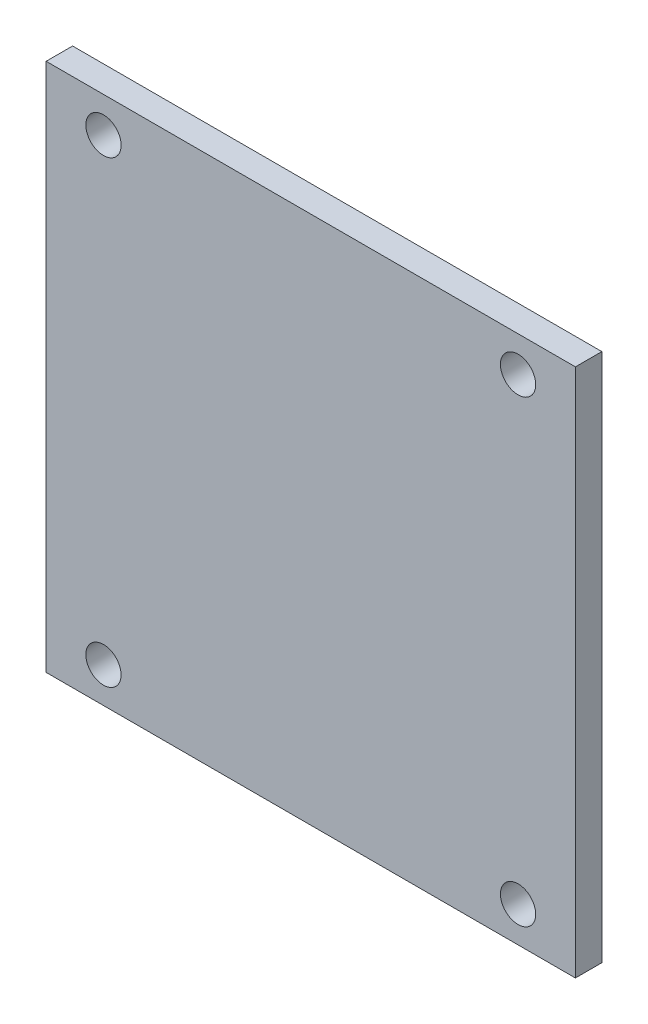
ISO-10303-21;
HEADER;
FILE_DESCRIPTION(('STEP AP214'),'2;1');
FILE_NAME('part.step','',(''),(''),'','','');
FILE_SCHEMA(('AUTOMOTIVE_DESIGN { 1 0 10303 214 1 1 1 1 }'));
ENDSEC;
DATA;
#1=APPLICATION_CONTEXT('core data for automotive mechanical design processes');
#2=APPLICATION_PROTOCOL_DEFINITION('international standard','automotive_design',2000,#1);
#3=PRODUCT_CONTEXT('',#1,'mechanical');
#4=PRODUCT('Part','Part','',(#3));
#5=PRODUCT_RELATED_PRODUCT_CATEGORY('part','',(#4));
#6=PRODUCT_DEFINITION_FORMATION('','',#4);
#7=PRODUCT_DEFINITION_CONTEXT('part definition',#1,'design');
#8=PRODUCT_DEFINITION('design','',#6,#7);
#9=PRODUCT_DEFINITION_SHAPE('','',#8);
#10=(LENGTH_UNIT() NAMED_UNIT(*) SI_UNIT(.MILLI.,.METRE.));
#11=(NAMED_UNIT(*) PLANE_ANGLE_UNIT() SI_UNIT($,.RADIAN.));
#12=(NAMED_UNIT(*) SI_UNIT($,.STERADIAN.) SOLID_ANGLE_UNIT());
#13=UNCERTAINTY_MEASURE_WITH_UNIT(LENGTH_MEASURE(1.E-05),#10,'distance_accuracy_value','');
#14=(GEOMETRIC_REPRESENTATION_CONTEXT(3) GLOBAL_UNCERTAINTY_ASSIGNED_CONTEXT((#13)) GLOBAL_UNIT_ASSIGNED_CONTEXT((#10,
#11,#12)) REPRESENTATION_CONTEXT('',''));
#15=CARTESIAN_POINT('',(0.,0.,0.));
#16=DIRECTION('',(0.,0.,1.));
#17=DIRECTION('',(1.,0.,0.));
#18=AXIS2_PLACEMENT_3D('',#15,#16,#17);
#19=CARTESIAN_POINT('',(30.,-30.,3.));
#20=DIRECTION('',(-1.,0.,0.));
#21=DIRECTION('',(0.,0.,1.));
#22=AXIS2_PLACEMENT_3D('',#19,#20,#21);
#23=PLANE('',#22);
#24=DIRECTION('',(0.,1.,0.));
#25=VECTOR('',#24,1.);
#26=CARTESIAN_POINT('',(30.,-30.,0.));
#27=LINE('',#26,#25);
#28=CARTESIAN_POINT('',(30.,-30.,0.));
#29=VERTEX_POINT('',#28);
#30=CARTESIAN_POINT('',(30.,30.,0.));
#31=VERTEX_POINT('',#30);
#32=EDGE_CURVE('E100',#29,#31,#27,.T.);
#33=ORIENTED_EDGE('',*,*,#32,.T.);
#34=DIRECTION('',(0.,0.,-1.));
#35=VECTOR('',#34,1.);
#36=CARTESIAN_POINT('',(30.,30.,3.));
#37=LINE('',#36,#35);
#38=CARTESIAN_POINT('',(30.,30.,3.));
#39=VERTEX_POINT('',#38);
#40=EDGE_CURVE('E11',#39,#31,#37,.T.);
#41=ORIENTED_EDGE('',*,*,#40,.F.);
#42=DIRECTION('',(0.,1.,0.));
#43=VECTOR('',#42,1.);
#44=CARTESIAN_POINT('',(30.,-30.,3.));
#45=LINE('',#44,#43);
#46=CARTESIAN_POINT('',(30.,-30.,3.));
#47=VERTEX_POINT('',#46);
#48=EDGE_CURVE('E88',#47,#39,#45,.T.);
#49=ORIENTED_EDGE('',*,*,#48,.F.);
#50=DIRECTION('',(0.,0.,-1.));
#51=VECTOR('',#50,1.);
#52=CARTESIAN_POINT('',(30.,-30.,3.));
#53=LINE('',#52,#51);
#54=EDGE_CURVE('E96',#47,#29,#53,.T.);
#55=ORIENTED_EDGE('',*,*,#54,.T.);
#56=EDGE_LOOP('',(#33,#41,#49,#55));
#57=FACE_BOUND('',#56,.T.);
#58=ADVANCED_FACE('F37',(#57),#23,.F.);
#59=CARTESIAN_POINT('',(-30.,30.,3.));
#60=DIRECTION('',(0.,-1.,0.));
#61=DIRECTION('',(0.,0.,-1.));
#62=AXIS2_PLACEMENT_3D('',#59,#60,#61);
#63=PLANE('',#62);
#64=DIRECTION('',(-1.,0.,0.));
#65=VECTOR('',#64,1.);
#66=CARTESIAN_POINT('',(-30.,30.,0.));
#67=LINE('',#66,#65);
#68=CARTESIAN_POINT('',(-30.,30.,0.));
#69=VERTEX_POINT('',#68);
#70=EDGE_CURVE('E92',#31,#69,#67,.T.);
#71=ORIENTED_EDGE('',*,*,#70,.T.);
#72=DIRECTION('',(0.,0.,-1.));
#73=VECTOR('',#72,1.);
#74=CARTESIAN_POINT('',(-30.,30.,3.));
#75=LINE('',#74,#73);
#76=CARTESIAN_POINT('',(-30.,30.,3.));
#77=VERTEX_POINT('',#76);
#78=EDGE_CURVE('E45',#77,#69,#75,.T.);
#79=ORIENTED_EDGE('',*,*,#78,.F.);
#80=DIRECTION('',(-1.,0.,0.));
#81=VECTOR('',#80,1.);
#82=CARTESIAN_POINT('',(-30.,30.,3.));
#83=LINE('',#82,#81);
#84=EDGE_CURVE('E83',#39,#77,#83,.T.);
#85=ORIENTED_EDGE('',*,*,#84,.F.);
#86=ORIENTED_EDGE('',*,*,#40,.T.);
#87=EDGE_LOOP('',(#71,#79,#85,#86));
#88=FACE_BOUND('',#87,.T.);
#89=ADVANCED_FACE('F91',(#88),#63,.F.);
#90=CARTESIAN_POINT('',(-30.,-30.,3.));
#91=DIRECTION('',(1.,0.,0.));
#92=DIRECTION('',(0.,0.,-1.));
#93=AXIS2_PLACEMENT_3D('',#90,#91,#92);
#94=PLANE('',#93);
#95=DIRECTION('',(0.,-1.,0.));
#96=VECTOR('',#95,1.);
#97=CARTESIAN_POINT('',(-30.,-30.,0.));
#98=LINE('',#97,#96);
#99=CARTESIAN_POINT('',(-30.,-30.,0.));
#100=VERTEX_POINT('',#99);
#101=EDGE_CURVE('E70',#69,#100,#98,.T.);
#102=ORIENTED_EDGE('',*,*,#101,.T.);
#103=DIRECTION('',(0.,0.,-1.));
#104=VECTOR('',#103,1.);
#105=CARTESIAN_POINT('',(-30.,-30.,3.));
#106=LINE('',#105,#104);
#107=CARTESIAN_POINT('',(-30.,-30.,3.));
#108=VERTEX_POINT('',#107);
#109=EDGE_CURVE('E93',#108,#100,#106,.T.);
#110=ORIENTED_EDGE('',*,*,#109,.F.);
#111=DIRECTION('',(0.,-1.,0.));
#112=VECTOR('',#111,1.);
#113=CARTESIAN_POINT('',(-30.,-30.,3.));
#114=LINE('',#113,#112);
#115=EDGE_CURVE('E86',#77,#108,#114,.T.);
#116=ORIENTED_EDGE('',*,*,#115,.F.);
#117=ORIENTED_EDGE('',*,*,#78,.T.);
#118=EDGE_LOOP('',(#102,#110,#116,#117));
#119=FACE_BOUND('',#118,.T.);
#120=ADVANCED_FACE('F94',(#119),#94,.F.);
#121=CARTESIAN_POINT('',(-30.,-30.,3.));
#122=DIRECTION('',(0.,1.,0.));
#123=DIRECTION('',(0.,0.,1.));
#124=AXIS2_PLACEMENT_3D('',#121,#122,#123);
#125=PLANE('',#124);
#126=DIRECTION('',(1.,0.,0.));
#127=VECTOR('',#126,1.);
#128=CARTESIAN_POINT('',(-30.,-30.,0.));
#129=LINE('',#128,#127);
#130=EDGE_CURVE('E76',#100,#29,#129,.T.);
#131=ORIENTED_EDGE('',*,*,#130,.T.);
#132=ORIENTED_EDGE('',*,*,#54,.F.);
#133=DIRECTION('',(1.,0.,0.));
#134=VECTOR('',#133,1.);
#135=CARTESIAN_POINT('',(-30.,-30.,3.));
#136=LINE('',#135,#134);
#137=EDGE_CURVE('E53',#108,#47,#136,.T.);
#138=ORIENTED_EDGE('',*,*,#137,.F.);
#139=ORIENTED_EDGE('',*,*,#109,.T.);
#140=EDGE_LOOP('',(#131,#132,#138,#139));
#141=FACE_BOUND('',#140,.T.);
#142=ADVANCED_FACE('F108',(#141),#125,.F.);
#143=CARTESIAN_POINT('',(0.,0.,3.));
#144=DIRECTION('',(0.,0.,-1.));
#145=DIRECTION('',(-1.,0.,0.));
#146=AXIS2_PLACEMENT_3D('',#143,#144,#145);
#147=PLANE('',#146);
#148=CARTESIAN_POINT('',(23.4999999999999,-26.0000000000001,3.));
#149=DIRECTION('',(0.,0.,1.));
#150=DIRECTION('',(1.,0.,0.));
#151=AXIS2_PLACEMENT_3D('',#148,#149,#150);
#152=CIRCLE('',#151,2.);
#153=CARTESIAN_POINT('',(25.4999999999999,-26.0000000000001,3.));
#154=VERTEX_POINT('',#153);
#155=EDGE_CURVE('E123',#154,#154,#152,.T.);
#156=ORIENTED_EDGE('',*,*,#155,.F.);
#157=EDGE_LOOP('',(#156));
#158=FACE_BOUND('',#157,.T.);
#159=CARTESIAN_POINT('',(-23.4999999999999,-26.0000000000001,3.));
#160=DIRECTION('',(0.,0.,1.));
#161=DIRECTION('',(1.,0.,0.));
#162=AXIS2_PLACEMENT_3D('',#159,#160,#161);
#163=CIRCLE('',#162,2.);
#164=CARTESIAN_POINT('',(-21.4999999999999,-26.0000000000001,3.));
#165=VERTEX_POINT('',#164);
#166=EDGE_CURVE('E129',#165,#165,#163,.T.);
#167=ORIENTED_EDGE('',*,*,#166,.F.);
#168=EDGE_LOOP('',(#167));
#169=FACE_BOUND('',#168,.T.);
#170=CARTESIAN_POINT('',(-23.4999999999999,26.0000000000001,3.));
#171=DIRECTION('',(0.,0.,1.));
#172=DIRECTION('',(1.,0.,0.));
#173=AXIS2_PLACEMENT_3D('',#170,#171,#172);
#174=CIRCLE('',#173,2.);
#175=CARTESIAN_POINT('',(-21.4999999999999,26.0000000000001,3.));
#176=VERTEX_POINT('',#175);
#177=EDGE_CURVE('E117',#176,#176,#174,.T.);
#178=ORIENTED_EDGE('',*,*,#177,.F.);
#179=EDGE_LOOP('',(#178));
#180=FACE_BOUND('',#179,.T.);
#181=CARTESIAN_POINT('',(23.4999999999999,26.0000000000001,3.));
#182=DIRECTION('',(0.,0.,1.));
#183=DIRECTION('',(1.,0.,0.));
#184=AXIS2_PLACEMENT_3D('',#181,#182,#183);
#185=CIRCLE('',#184,2.);
#186=CARTESIAN_POINT('',(25.4999999999999,26.0000000000001,3.));
#187=VERTEX_POINT('',#186);
#188=EDGE_CURVE('E103',#187,#187,#185,.T.);
#189=ORIENTED_EDGE('',*,*,#188,.F.);
#190=EDGE_LOOP('',(#189));
#191=FACE_BOUND('',#190,.T.);
#192=ORIENTED_EDGE('',*,*,#48,.T.);
#193=ORIENTED_EDGE('',*,*,#84,.T.);
#194=ORIENTED_EDGE('',*,*,#115,.T.);
#195=ORIENTED_EDGE('',*,*,#137,.T.);
#196=EDGE_LOOP('',(#192,#193,#194,#195));
#197=FACE_BOUND('',#196,.T.);
#198=ADVANCED_FACE('F84',(#158,#169,#180,#191,#197),#147,.F.);
#199=CARTESIAN_POINT('',(0.,0.,0.));
#200=DIRECTION('',(0.,0.,-1.));
#201=DIRECTION('',(-1.,0.,0.));
#202=AXIS2_PLACEMENT_3D('',#199,#200,#201);
#203=PLANE('',#202);
#204=CARTESIAN_POINT('',(23.4999999999999,-26.0000000000001,0.));
#205=DIRECTION('',(0.,0.,1.));
#206=DIRECTION('',(1.,0.,0.));
#207=AXIS2_PLACEMENT_3D('',#204,#205,#206);
#208=CIRCLE('',#207,2.);
#209=CARTESIAN_POINT('',(25.4999999999999,-26.0000000000001,0.));
#210=VERTEX_POINT('',#209);
#211=EDGE_CURVE('E120',#210,#210,#208,.T.);
#212=ORIENTED_EDGE('',*,*,#211,.T.);
#213=EDGE_LOOP('',(#212));
#214=FACE_BOUND('',#213,.T.);
#215=CARTESIAN_POINT('',(-23.4999999999999,-26.0000000000001,0.));
#216=DIRECTION('',(0.,0.,1.));
#217=DIRECTION('',(1.,0.,0.));
#218=AXIS2_PLACEMENT_3D('',#215,#216,#217);
#219=CIRCLE('',#218,2.);
#220=CARTESIAN_POINT('',(-21.4999999999999,-26.0000000000001,0.));
#221=VERTEX_POINT('',#220);
#222=EDGE_CURVE('E126',#221,#221,#219,.T.);
#223=ORIENTED_EDGE('',*,*,#222,.T.);
#224=EDGE_LOOP('',(#223));
#225=FACE_BOUND('',#224,.T.);
#226=CARTESIAN_POINT('',(-23.4999999999999,26.0000000000001,0.));
#227=DIRECTION('',(0.,0.,1.));
#228=DIRECTION('',(1.,0.,0.));
#229=AXIS2_PLACEMENT_3D('',#226,#227,#228);
#230=CIRCLE('',#229,2.);
#231=CARTESIAN_POINT('',(-21.4999999999999,26.0000000000001,0.));
#232=VERTEX_POINT('',#231);
#233=EDGE_CURVE('E132',#232,#232,#230,.T.);
#234=ORIENTED_EDGE('',*,*,#233,.T.);
#235=EDGE_LOOP('',(#234));
#236=FACE_BOUND('',#235,.T.);
#237=CARTESIAN_POINT('',(23.4999999999999,26.0000000000001,0.));
#238=DIRECTION('',(0.,0.,1.));
#239=DIRECTION('',(1.,0.,0.));
#240=AXIS2_PLACEMENT_3D('',#237,#238,#239);
#241=CIRCLE('',#240,2.);
#242=CARTESIAN_POINT('',(25.4999999999999,26.0000000000001,0.));
#243=VERTEX_POINT('',#242);
#244=EDGE_CURVE('E114',#243,#243,#241,.T.);
#245=ORIENTED_EDGE('',*,*,#244,.T.);
#246=EDGE_LOOP('',(#245));
#247=FACE_BOUND('',#246,.T.);
#248=ORIENTED_EDGE('',*,*,#32,.F.);
#249=ORIENTED_EDGE('',*,*,#130,.F.);
#250=ORIENTED_EDGE('',*,*,#101,.F.);
#251=ORIENTED_EDGE('',*,*,#70,.F.);
#252=EDGE_LOOP('',(#248,#249,#250,#251));
#253=FACE_BOUND('',#252,.T.);
#254=ADVANCED_FACE('F111',(#214,#225,#236,#247,#253),#203,.T.);
#255=CARTESIAN_POINT('',(23.4999999999999,26.0000000000001,3.));
#256=DIRECTION('',(0.,0.,-1.));
#257=DIRECTION('',(-1.,0.,0.));
#258=AXIS2_PLACEMENT_3D('',#255,#256,#257);
#259=CYLINDRICAL_SURFACE('',#258,2.);
#260=ORIENTED_EDGE('',*,*,#188,.T.);
#261=EDGE_LOOP('',(#260));
#262=FACE_BOUND('',#261,.T.);
#263=ORIENTED_EDGE('',*,*,#244,.F.);
#264=EDGE_LOOP('',(#263));
#265=FACE_BOUND('',#264,.T.);
#266=ADVANCED_FACE('F147',(#262,#265),#259,.F.);
#267=CARTESIAN_POINT('',(-23.4999999999999,26.0000000000001,3.));
#268=DIRECTION('',(0.,0.,-1.));
#269=DIRECTION('',(-1.,0.,0.));
#270=AXIS2_PLACEMENT_3D('',#267,#268,#269);
#271=CYLINDRICAL_SURFACE('',#270,2.);
#272=ORIENTED_EDGE('',*,*,#177,.T.);
#273=EDGE_LOOP('',(#272));
#274=FACE_BOUND('',#273,.T.);
#275=ORIENTED_EDGE('',*,*,#233,.F.);
#276=EDGE_LOOP('',(#275));
#277=FACE_BOUND('',#276,.T.);
#278=ADVANCED_FACE('F138',(#274,#277),#271,.F.);
#279=CARTESIAN_POINT('',(-23.4999999999999,-26.0000000000001,3.));
#280=DIRECTION('',(0.,0.,-1.));
#281=DIRECTION('',(-1.,0.,0.));
#282=AXIS2_PLACEMENT_3D('',#279,#280,#281);
#283=CYLINDRICAL_SURFACE('',#282,2.);
#284=ORIENTED_EDGE('',*,*,#166,.T.);
#285=EDGE_LOOP('',(#284));
#286=FACE_BOUND('',#285,.T.);
#287=ORIENTED_EDGE('',*,*,#222,.F.);
#288=EDGE_LOOP('',(#287));
#289=FACE_BOUND('',#288,.T.);
#290=ADVANCED_FACE('F199',(#286,#289),#283,.F.);
#291=CARTESIAN_POINT('',(23.4999999999999,-26.0000000000001,3.));
#292=DIRECTION('',(0.,0.,-1.));
#293=DIRECTION('',(-1.,0.,0.));
#294=AXIS2_PLACEMENT_3D('',#291,#292,#293);
#295=CYLINDRICAL_SURFACE('',#294,2.);
#296=ORIENTED_EDGE('',*,*,#155,.T.);
#297=EDGE_LOOP('',(#296));
#298=FACE_BOUND('',#297,.T.);
#299=ORIENTED_EDGE('',*,*,#211,.F.);
#300=EDGE_LOOP('',(#299));
#301=FACE_BOUND('',#300,.T.);
#302=ADVANCED_FACE('F209',(#298,#301),#295,.F.);
#303=CLOSED_SHELL('',(#58,#89,#120,#142,#198,#254,#266,#278,#290,#302));
#304=MANIFOLD_SOLID_BREP('B2',#303);
#305=ADVANCED_BREP_SHAPE_REPRESENTATION('',(#18,#304),#14);
#306=SHAPE_DEFINITION_REPRESENTATION(#9,#305);
ENDSEC;
END-ISO-10303-21;
